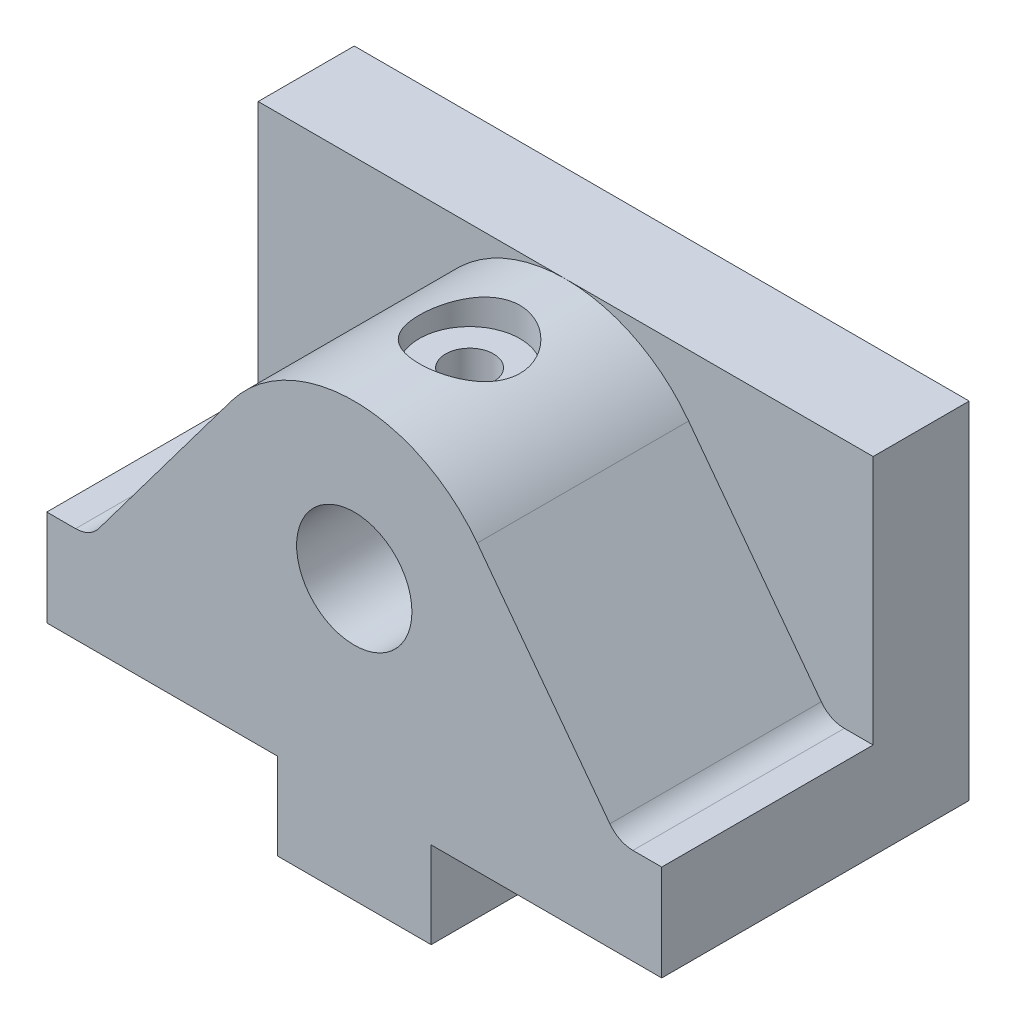
ISO-10303-21;
HEADER;
FILE_DESCRIPTION(('STEP AP214'),'2;1');
FILE_NAME('part.step','',(''),(''),'','','');
FILE_SCHEMA(('AUTOMOTIVE_DESIGN { 1 0 10303 214 1 1 1 1 }'));
ENDSEC;
DATA;
#1=APPLICATION_CONTEXT('core data for automotive mechanical design processes');
#2=APPLICATION_PROTOCOL_DEFINITION('international standard','automotive_design',2000,#1);
#3=PRODUCT_CONTEXT('',#1,'mechanical');
#4=PRODUCT('Part','Part','',(#3));
#5=PRODUCT_RELATED_PRODUCT_CATEGORY('part','',(#4));
#6=PRODUCT_DEFINITION_FORMATION('','',#4);
#7=PRODUCT_DEFINITION_CONTEXT('part definition',#1,'design');
#8=PRODUCT_DEFINITION('design','',#6,#7);
#9=PRODUCT_DEFINITION_SHAPE('','',#8);
#10=(LENGTH_UNIT() NAMED_UNIT(*) SI_UNIT(.MILLI.,.METRE.));
#11=(NAMED_UNIT(*) PLANE_ANGLE_UNIT() SI_UNIT($,.RADIAN.));
#12=(NAMED_UNIT(*) SI_UNIT($,.STERADIAN.) SOLID_ANGLE_UNIT());
#13=UNCERTAINTY_MEASURE_WITH_UNIT(LENGTH_MEASURE(1.E-05),#10,'distance_accuracy_value','');
#14=(GEOMETRIC_REPRESENTATION_CONTEXT(3) GLOBAL_UNCERTAINTY_ASSIGNED_CONTEXT((#13)) GLOBAL_UNIT_ASSIGNED_CONTEXT((#10,
#11,#12)) REPRESENTATION_CONTEXT('',''));
#15=CARTESIAN_POINT('',(0.,0.,0.));
#16=DIRECTION('',(0.,0.,1.));
#17=DIRECTION('',(1.,0.,0.));
#18=AXIS2_PLACEMENT_3D('',#15,#16,#17);
#19=CARTESIAN_POINT('',(32.,22.,32.));
#20=DIRECTION('',(-1.,0.,0.));
#21=DIRECTION('',(0.,-1.,0.));
#22=AXIS2_PLACEMENT_3D('',#19,#20,#21);
#23=PLANE('',#22);
#24=DIRECTION('',(0.,-1.,0.));
#25=VECTOR('',#24,1.);
#26=CARTESIAN_POINT('',(32.,22.,10.));
#27=LINE('',#26,#25);
#28=CARTESIAN_POINT('',(32.,22.,10.));
#29=VERTEX_POINT('',#28);
#30=CARTESIAN_POINT('',(32.,-4.,10.));
#31=VERTEX_POINT('',#30);
#32=EDGE_CURVE('E321',#29,#31,#27,.T.);
#33=ORIENTED_EDGE('',*,*,#32,.T.);
#34=DIRECTION('',(0.,0.,1.));
#35=VECTOR('',#34,1.);
#36=CARTESIAN_POINT('',(32.,-4.,32.));
#37=LINE('',#36,#35);
#38=CARTESIAN_POINT('',(32.,-4.,32.));
#39=VERTEX_POINT('',#38);
#40=EDGE_CURVE('E310',#31,#39,#37,.T.);
#41=ORIENTED_EDGE('',*,*,#40,.T.);
#42=DIRECTION('',(0.,1.,0.));
#43=VECTOR('',#42,1.);
#44=CARTESIAN_POINT('',(32.,22.,32.));
#45=LINE('',#44,#43);
#46=CARTESIAN_POINT('',(32.,-14.,32.));
#47=VERTEX_POINT('',#46);
#48=EDGE_CURVE('E324',#47,#39,#45,.T.);
#49=ORIENTED_EDGE('',*,*,#48,.F.);
#50=DIRECTION('',(0.,0.,-1.));
#51=VECTOR('',#50,1.);
#52=CARTESIAN_POINT('',(32.,-14.,32.));
#53=LINE('',#52,#51);
#54=CARTESIAN_POINT('',(32.,-14.,0.));
#55=VERTEX_POINT('',#54);
#56=EDGE_CURVE('E340',#47,#55,#53,.T.);
#57=ORIENTED_EDGE('',*,*,#56,.T.);
#58=DIRECTION('',(0.,1.,0.));
#59=VECTOR('',#58,1.);
#60=CARTESIAN_POINT('',(32.,22.,0.));
#61=LINE('',#60,#59);
#62=CARTESIAN_POINT('',(32.,22.,0.));
#63=VERTEX_POINT('',#62);
#64=EDGE_CURVE('E323',#55,#63,#61,.T.);
#65=ORIENTED_EDGE('',*,*,#64,.T.);
#66=DIRECTION('',(0.,0.,-1.));
#67=VECTOR('',#66,1.);
#68=CARTESIAN_POINT('',(32.,22.,32.));
#69=LINE('',#68,#67);
#70=EDGE_CURVE('E294',#29,#63,#69,.T.);
#71=ORIENTED_EDGE('',*,*,#70,.F.);
#72=EDGE_LOOP('',(#33,#41,#49,#57,#65,#71));
#73=FACE_BOUND('',#72,.T.);
#74=ADVANCED_FACE('F33',(#73),#23,.F.);
#75=CARTESIAN_POINT('',(-32.,22.,32.));
#76=DIRECTION('',(0.,-1.,0.));
#77=DIRECTION('',(1.,0.,0.));
#78=AXIS2_PLACEMENT_3D('',#75,#76,#77);
#79=PLANE('',#78);
#80=DIRECTION('',(0.,0.,-1.));
#81=VECTOR('',#80,1.);
#82=CARTESIAN_POINT('',(-32.,22.,32.));
#83=LINE('',#82,#81);
#84=CARTESIAN_POINT('',(-32.,22.,10.));
#85=VERTEX_POINT('',#84);
#86=CARTESIAN_POINT('',(-32.,22.,0.));
#87=VERTEX_POINT('',#86);
#88=EDGE_CURVE('E374',#85,#87,#83,.T.);
#89=ORIENTED_EDGE('',*,*,#88,.F.);
#90=DIRECTION('',(1.,0.,0.));
#91=VECTOR('',#90,1.);
#92=CARTESIAN_POINT('',(-32.,22.,10.));
#93=LINE('',#92,#91);
#94=CARTESIAN_POINT('',(0.,22.,10.));
#95=VERTEX_POINT('',#94);
#96=EDGE_CURVE('E317',#85,#95,#93,.T.);
#97=ORIENTED_EDGE('',*,*,#96,.T.);
#98=EDGE_CURVE('E320',#95,#29,#93,.T.);
#99=ORIENTED_EDGE('',*,*,#98,.T.);
#100=ORIENTED_EDGE('',*,*,#70,.T.);
#101=DIRECTION('',(-1.,0.,0.));
#102=VECTOR('',#101,1.);
#103=CARTESIAN_POINT('',(-32.,22.,0.));
#104=LINE('',#103,#102);
#105=EDGE_CURVE('E343',#63,#87,#104,.T.);
#106=ORIENTED_EDGE('',*,*,#105,.T.);
#107=EDGE_LOOP('',(#89,#97,#99,#100,#106));
#108=FACE_BOUND('',#107,.T.);
#109=ADVANCED_FACE('F228',(#108),#79,.F.);
#110=CARTESIAN_POINT('',(-32.,22.,32.));
#111=DIRECTION('',(1.,0.,0.));
#112=DIRECTION('',(0.,1.,0.));
#113=AXIS2_PLACEMENT_3D('',#110,#111,#112);
#114=PLANE('',#113);
#115=DIRECTION('',(0.,-1.,0.));
#116=VECTOR('',#115,1.);
#117=CARTESIAN_POINT('',(-32.,22.,32.));
#118=LINE('',#117,#116);
#119=CARTESIAN_POINT('',(-32.,-4.,32.));
#120=VERTEX_POINT('',#119);
#121=CARTESIAN_POINT('',(-32.,-14.,32.));
#122=VERTEX_POINT('',#121);
#123=EDGE_CURVE('E327',#120,#122,#118,.T.);
#124=ORIENTED_EDGE('',*,*,#123,.F.);
#125=DIRECTION('',(0.,0.,-1.));
#126=VECTOR('',#125,1.);
#127=CARTESIAN_POINT('',(-32.,-4.,32.));
#128=LINE('',#127,#126);
#129=CARTESIAN_POINT('',(-32.,-4.,10.));
#130=VERTEX_POINT('',#129);
#131=EDGE_CURVE('E314',#120,#130,#128,.T.);
#132=ORIENTED_EDGE('',*,*,#131,.T.);
#133=DIRECTION('',(0.,1.,0.));
#134=VECTOR('',#133,1.);
#135=CARTESIAN_POINT('',(-32.,22.,10.));
#136=LINE('',#135,#134);
#137=EDGE_CURVE('E378',#130,#85,#136,.T.);
#138=ORIENTED_EDGE('',*,*,#137,.T.);
#139=ORIENTED_EDGE('',*,*,#88,.T.);
#140=DIRECTION('',(0.,-1.,0.));
#141=VECTOR('',#140,1.);
#142=CARTESIAN_POINT('',(-32.,22.,0.));
#143=LINE('',#142,#141);
#144=CARTESIAN_POINT('',(-32.,-14.,0.));
#145=VERTEX_POINT('',#144);
#146=EDGE_CURVE('E346',#87,#145,#143,.T.);
#147=ORIENTED_EDGE('',*,*,#146,.T.);
#148=DIRECTION('',(0.,0.,-1.));
#149=VECTOR('',#148,1.);
#150=CARTESIAN_POINT('',(-32.,-14.,32.));
#151=LINE('',#150,#149);
#152=EDGE_CURVE('E371',#122,#145,#151,.T.);
#153=ORIENTED_EDGE('',*,*,#152,.F.);
#154=EDGE_LOOP('',(#124,#132,#138,#139,#147,#153));
#155=FACE_BOUND('',#154,.T.);
#156=ADVANCED_FACE('F234',(#155),#114,.F.);
#157=CARTESIAN_POINT('',(-32.,-14.,32.));
#158=DIRECTION('',(0.,1.,0.));
#159=DIRECTION('',(-1.,0.,0.));
#160=AXIS2_PLACEMENT_3D('',#157,#158,#159);
#161=PLANE('',#160);
#162=DIRECTION('',(1.,0.,0.));
#163=VECTOR('',#162,1.);
#164=CARTESIAN_POINT('',(-32.,-14.,0.));
#165=LINE('',#164,#163);
#166=CARTESIAN_POINT('',(-7.99999999999999,-14.,0.));
#167=VERTEX_POINT('',#166);
#168=EDGE_CURVE('E348',#145,#167,#165,.T.);
#169=ORIENTED_EDGE('',*,*,#168,.T.);
#170=DIRECTION('',(0.,0.,-1.));
#171=VECTOR('',#170,1.);
#172=CARTESIAN_POINT('',(-7.99999999999999,-14.,32.));
#173=LINE('',#172,#171);
#174=CARTESIAN_POINT('',(-7.99999999999999,-14.,32.));
#175=VERTEX_POINT('',#174);
#176=EDGE_CURVE('E368',#175,#167,#173,.T.);
#177=ORIENTED_EDGE('',*,*,#176,.F.);
#178=DIRECTION('',(1.,0.,0.));
#179=VECTOR('',#178,1.);
#180=CARTESIAN_POINT('',(-32.,-14.,32.));
#181=LINE('',#180,#179);
#182=EDGE_CURVE('E330',#122,#175,#181,.T.);
#183=ORIENTED_EDGE('',*,*,#182,.F.);
#184=ORIENTED_EDGE('',*,*,#152,.T.);
#185=EDGE_LOOP('',(#169,#177,#183,#184));
#186=FACE_BOUND('',#185,.T.);
#187=ADVANCED_FACE('F394',(#186),#161,.F.);
#188=CARTESIAN_POINT('',(-7.99999999999999,-14.,32.));
#189=DIRECTION('',(1.,0.,0.));
#190=DIRECTION('',(0.,1.,0.));
#191=AXIS2_PLACEMENT_3D('',#188,#189,#190);
#192=PLANE('',#191);
#193=DIRECTION('',(0.,-1.,0.));
#194=VECTOR('',#193,1.);
#195=CARTESIAN_POINT('',(-7.99999999999999,-14.,0.));
#196=LINE('',#195,#194);
#197=CARTESIAN_POINT('',(-7.99999999999999,-23.,0.));
#198=VERTEX_POINT('',#197);
#199=EDGE_CURVE('E350',#167,#198,#196,.T.);
#200=ORIENTED_EDGE('',*,*,#199,.T.);
#201=DIRECTION('',(0.,0.,-1.));
#202=VECTOR('',#201,1.);
#203=CARTESIAN_POINT('',(-7.99999999999999,-23.,32.));
#204=LINE('',#203,#202);
#205=CARTESIAN_POINT('',(-7.99999999999999,-23.,32.));
#206=VERTEX_POINT('',#205);
#207=EDGE_CURVE('E365',#206,#198,#204,.T.);
#208=ORIENTED_EDGE('',*,*,#207,.F.);
#209=DIRECTION('',(0.,-1.,0.));
#210=VECTOR('',#209,1.);
#211=CARTESIAN_POINT('',(-7.99999999999999,-14.,32.));
#212=LINE('',#211,#210);
#213=EDGE_CURVE('E332',#175,#206,#212,.T.);
#214=ORIENTED_EDGE('',*,*,#213,.F.);
#215=ORIENTED_EDGE('',*,*,#176,.T.);
#216=EDGE_LOOP('',(#200,#208,#214,#215));
#217=FACE_BOUND('',#216,.T.);
#218=ADVANCED_FACE('F398',(#217),#192,.F.);
#219=CARTESIAN_POINT('',(8.00000000000001,-23.,32.));
#220=DIRECTION('',(0.,1.,0.));
#221=DIRECTION('',(-1.,0.,0.));
#222=AXIS2_PLACEMENT_3D('',#219,#220,#221);
#223=PLANE('',#222);
#224=CARTESIAN_POINT('',(0.,-23.,24.));
#225=DIRECTION('',(0.,-1.,0.));
#226=DIRECTION('',(0.,0.,-1.));
#227=AXIS2_PLACEMENT_3D('',#224,#225,#226);
#228=CIRCLE('',#227,2.49999999999999);
#229=CARTESIAN_POINT('',(0.,-23.,21.5));
#230=VERTEX_POINT('',#229);
#231=EDGE_CURVE('E174',#230,#230,#228,.T.);
#232=ORIENTED_EDGE('',*,*,#231,.F.);
#233=EDGE_LOOP('',(#232));
#234=FACE_BOUND('',#233,.T.);
#235=CARTESIAN_POINT('',(0.,-23.,8.));
#236=DIRECTION('',(0.,-1.,0.));
#237=DIRECTION('',(0.,0.,-1.));
#238=AXIS2_PLACEMENT_3D('',#235,#236,#237);
#239=CIRCLE('',#238,2.49999999999999);
#240=CARTESIAN_POINT('',(0.,-23.,5.50000000000001));
#241=VERTEX_POINT('',#240);
#242=EDGE_CURVE('E173',#241,#241,#239,.T.);
#243=ORIENTED_EDGE('',*,*,#242,.F.);
#244=EDGE_LOOP('',(#243));
#245=FACE_BOUND('',#244,.T.);
#246=DIRECTION('',(1.,0.,0.));
#247=VECTOR('',#246,1.);
#248=CARTESIAN_POINT('',(8.00000000000001,-23.,0.));
#249=LINE('',#248,#247);
#250=CARTESIAN_POINT('',(8.00000000000001,-23.,0.));
#251=VERTEX_POINT('',#250);
#252=EDGE_CURVE('E352',#198,#251,#249,.T.);
#253=ORIENTED_EDGE('',*,*,#252,.T.);
#254=DIRECTION('',(0.,0.,-1.));
#255=VECTOR('',#254,1.);
#256=CARTESIAN_POINT('',(8.00000000000001,-23.,32.));
#257=LINE('',#256,#255);
#258=CARTESIAN_POINT('',(8.00000000000001,-23.,32.));
#259=VERTEX_POINT('',#258);
#260=EDGE_CURVE('E362',#259,#251,#257,.T.);
#261=ORIENTED_EDGE('',*,*,#260,.F.);
#262=DIRECTION('',(1.,0.,0.));
#263=VECTOR('',#262,1.);
#264=CARTESIAN_POINT('',(8.00000000000001,-23.,32.));
#265=LINE('',#264,#263);
#266=EDGE_CURVE('E334',#206,#259,#265,.T.);
#267=ORIENTED_EDGE('',*,*,#266,.F.);
#268=ORIENTED_EDGE('',*,*,#207,.T.);
#269=EDGE_LOOP('',(#253,#261,#267,#268));
#270=FACE_BOUND('',#269,.T.);
#271=ADVANCED_FACE('F403',(#234,#245,#270),#223,.F.);
#272=CARTESIAN_POINT('',(8.00000000000001,-14.,32.));
#273=DIRECTION('',(-1.,0.,0.));
#274=DIRECTION('',(0.,-1.,0.));
#275=AXIS2_PLACEMENT_3D('',#272,#273,#274);
#276=PLANE('',#275);
#277=DIRECTION('',(0.,1.,0.));
#278=VECTOR('',#277,1.);
#279=CARTESIAN_POINT('',(8.00000000000001,-14.,0.));
#280=LINE('',#279,#278);
#281=CARTESIAN_POINT('',(8.00000000000001,-14.,0.));
#282=VERTEX_POINT('',#281);
#283=EDGE_CURVE('E354',#251,#282,#280,.T.);
#284=ORIENTED_EDGE('',*,*,#283,.T.);
#285=DIRECTION('',(0.,0.,-1.));
#286=VECTOR('',#285,1.);
#287=CARTESIAN_POINT('',(8.00000000000001,-14.,32.));
#288=LINE('',#287,#286);
#289=CARTESIAN_POINT('',(8.00000000000001,-14.,32.));
#290=VERTEX_POINT('',#289);
#291=EDGE_CURVE('E359',#290,#282,#288,.T.);
#292=ORIENTED_EDGE('',*,*,#291,.F.);
#293=DIRECTION('',(0.,1.,0.));
#294=VECTOR('',#293,1.);
#295=CARTESIAN_POINT('',(8.00000000000001,-14.,32.));
#296=LINE('',#295,#294);
#297=EDGE_CURVE('E336',#259,#290,#296,.T.);
#298=ORIENTED_EDGE('',*,*,#297,.F.);
#299=ORIENTED_EDGE('',*,*,#260,.T.);
#300=EDGE_LOOP('',(#284,#292,#298,#299));
#301=FACE_BOUND('',#300,.T.);
#302=ADVANCED_FACE('F409',(#301),#276,.F.);
#303=CARTESIAN_POINT('',(32.,-14.,32.));
#304=DIRECTION('',(0.,1.,0.));
#305=DIRECTION('',(-1.,0.,0.));
#306=AXIS2_PLACEMENT_3D('',#303,#304,#305);
#307=PLANE('',#306);
#308=DIRECTION('',(1.,0.,0.));
#309=VECTOR('',#308,1.);
#310=CARTESIAN_POINT('',(32.,-14.,0.));
#311=LINE('',#310,#309);
#312=EDGE_CURVE('E328',#282,#55,#311,.T.);
#313=ORIENTED_EDGE('',*,*,#312,.T.);
#314=ORIENTED_EDGE('',*,*,#56,.F.);
#315=DIRECTION('',(1.,0.,0.));
#316=VECTOR('',#315,1.);
#317=CARTESIAN_POINT('',(32.,-14.,32.));
#318=LINE('',#317,#316);
#319=EDGE_CURVE('E338',#290,#47,#318,.T.);
#320=ORIENTED_EDGE('',*,*,#319,.F.);
#321=ORIENTED_EDGE('',*,*,#291,.T.);
#322=EDGE_LOOP('',(#313,#314,#320,#321));
#323=FACE_BOUND('',#322,.T.);
#324=ADVANCED_FACE('F413',(#323),#307,.F.);
#325=CARTESIAN_POINT('',(32.,-23.,32.));
#326=DIRECTION('',(0.,0.,-1.));
#327=DIRECTION('',(-1.,0.,0.));
#328=AXIS2_PLACEMENT_3D('',#325,#326,#327);
#329=PLANE('',#328);
#330=CARTESIAN_POINT('',(0.,6.,32.));
#331=DIRECTION('',(0.,0.,1.));
#332=DIRECTION('',(1.,0.,0.));
#333=AXIS2_PLACEMENT_3D('',#330,#331,#332);
#334=CIRCLE('',#333,6.);
#335=CARTESIAN_POINT('',(6.,6.,32.));
#336=VERTEX_POINT('',#335);
#337=EDGE_CURVE('E197',#336,#336,#334,.T.);
#338=ORIENTED_EDGE('',*,*,#337,.F.);
#339=EDGE_LOOP('',(#338));
#340=FACE_BOUND('',#339,.T.);
#341=DIRECTION('',(0.6,0.8,0.));
#342=VECTOR('',#341,1.);
#343=CARTESIAN_POINT('',(-12.8,15.6,32.));
#344=LINE('',#343,#342);
#345=CARTESIAN_POINT('',(-26.6,-2.80000000000001,32.));
#346=VERTEX_POINT('',#345);
#347=CARTESIAN_POINT('',(-12.8,15.6,32.));
#348=VERTEX_POINT('',#347);
#349=EDGE_CURVE('E300',#346,#348,#344,.T.);
#350=ORIENTED_EDGE('',*,*,#349,.F.);
#351=CARTESIAN_POINT('',(-29.,-1.00000000000001,32.));
#352=DIRECTION('',(0.,0.,-1.));
#353=DIRECTION('',(-1.,0.,0.));
#354=AXIS2_PLACEMENT_3D('',#351,#352,#353);
#355=CIRCLE('',#354,3.);
#356=CARTESIAN_POINT('',(-29.,-4.00000000000001,32.));
#357=VERTEX_POINT('',#356);
#358=EDGE_CURVE('E271',#346,#357,#355,.T.);
#359=ORIENTED_EDGE('',*,*,#358,.T.);
#360=DIRECTION('',(-1.,0.,0.));
#361=VECTOR('',#360,1.);
#362=CARTESIAN_POINT('',(32.,-4.00000000000004,32.));
#363=LINE('',#362,#361);
#364=EDGE_CURVE('E293',#357,#120,#363,.T.);
#365=ORIENTED_EDGE('',*,*,#364,.T.);
#366=ORIENTED_EDGE('',*,*,#123,.T.);
#367=ORIENTED_EDGE('',*,*,#182,.T.);
#368=ORIENTED_EDGE('',*,*,#213,.T.);
#369=ORIENTED_EDGE('',*,*,#266,.T.);
#370=ORIENTED_EDGE('',*,*,#297,.T.);
#371=ORIENTED_EDGE('',*,*,#319,.T.);
#372=ORIENTED_EDGE('',*,*,#48,.T.);
#373=DIRECTION('',(1.,0.,0.));
#374=VECTOR('',#373,1.);
#375=CARTESIAN_POINT('',(38.9732794450173,-4.,32.));
#376=LINE('',#375,#374);
#377=CARTESIAN_POINT('',(29.,-4.,32.));
#378=VERTEX_POINT('',#377);
#379=EDGE_CURVE('E298',#378,#39,#376,.T.);
#380=ORIENTED_EDGE('',*,*,#379,.F.);
#381=CARTESIAN_POINT('',(29.,-0.999999999999997,32.));
#382=DIRECTION('',(0.,0.,-1.));
#383=DIRECTION('',(-1.,0.,0.));
#384=AXIS2_PLACEMENT_3D('',#381,#382,#383);
#385=CIRCLE('',#384,3.);
#386=CARTESIAN_POINT('',(26.6,-2.8,32.));
#387=VERTEX_POINT('',#386);
#388=EDGE_CURVE('E272',#378,#387,#385,.T.);
#389=ORIENTED_EDGE('',*,*,#388,.T.);
#390=DIRECTION('',(0.6,-0.8,0.));
#391=VECTOR('',#390,1.);
#392=CARTESIAN_POINT('',(12.8,15.6,32.));
#393=LINE('',#392,#391);
#394=CARTESIAN_POINT('',(12.8,15.6,32.));
#395=VERTEX_POINT('',#394);
#396=EDGE_CURVE('E296',#395,#387,#393,.T.);
#397=ORIENTED_EDGE('',*,*,#396,.F.);
#398=CARTESIAN_POINT('',(0.,6.,32.));
#399=DIRECTION('',(0.,0.,-1.));
#400=DIRECTION('',(-1.,0.,0.));
#401=AXIS2_PLACEMENT_3D('',#398,#399,#400);
#402=CIRCLE('',#401,16.);
#403=EDGE_CURVE('E286',#395,#348,#402,.F.);
#404=ORIENTED_EDGE('',*,*,#403,.T.);
#405=EDGE_LOOP('',(#350,#359,#365,#366,#367,#368,#369,#370,#371,#372,#380,#389,#397,#404));
#406=FACE_BOUND('',#405,.T.);
#407=ADVANCED_FACE('F297',(#340,#406),#329,.F.);
#408=CARTESIAN_POINT('',(32.,-23.,0.));
#409=DIRECTION('',(0.,0.,-1.));
#410=DIRECTION('',(-1.,0.,0.));
#411=AXIS2_PLACEMENT_3D('',#408,#409,#410);
#412=PLANE('',#411);
#413=ORIENTED_EDGE('',*,*,#64,.F.);
#414=ORIENTED_EDGE('',*,*,#312,.F.);
#415=ORIENTED_EDGE('',*,*,#283,.F.);
#416=ORIENTED_EDGE('',*,*,#252,.F.);
#417=ORIENTED_EDGE('',*,*,#199,.F.);
#418=ORIENTED_EDGE('',*,*,#168,.F.);
#419=ORIENTED_EDGE('',*,*,#146,.F.);
#420=ORIENTED_EDGE('',*,*,#105,.F.);
#421=EDGE_LOOP('',(#413,#414,#415,#416,#417,#418,#419,#420));
#422=FACE_BOUND('',#421,.T.);
#423=ADVANCED_FACE('F437',(#422),#412,.T.);
#424=CARTESIAN_POINT('',(0.,6.,10.));
#425=DIRECTION('',(0.,0.,-1.));
#426=DIRECTION('',(-1.,0.,0.));
#427=AXIS2_PLACEMENT_3D('',#424,#425,#426);
#428=PLANE('',#427);
#429=DIRECTION('',(0.6,-0.8,0.));
#430=VECTOR('',#429,1.);
#431=CARTESIAN_POINT('',(12.8,15.6,10.));
#432=LINE('',#431,#430);
#433=CARTESIAN_POINT('',(12.8,15.6,10.));
#434=VERTEX_POINT('',#433);
#435=CARTESIAN_POINT('',(26.6,-2.8,10.));
#436=VERTEX_POINT('',#435);
#437=EDGE_CURVE('E425',#434,#436,#432,.T.);
#438=ORIENTED_EDGE('',*,*,#437,.T.);
#439=CARTESIAN_POINT('',(29.,-0.999999999999997,10.));
#440=DIRECTION('',(0.,0.,-1.));
#441=DIRECTION('',(-1.,0.,0.));
#442=AXIS2_PLACEMENT_3D('',#439,#440,#441);
#443=CIRCLE('',#442,3.);
#444=CARTESIAN_POINT('',(29.,-4.,10.));
#445=VERTEX_POINT('',#444);
#446=EDGE_CURVE('E269',#436,#445,#443,.F.);
#447=ORIENTED_EDGE('',*,*,#446,.T.);
#448=DIRECTION('',(1.,0.,0.));
#449=VECTOR('',#448,1.);
#450=CARTESIAN_POINT('',(27.5,-4.,10.));
#451=LINE('',#450,#449);
#452=EDGE_CURVE('E421',#445,#31,#451,.T.);
#453=ORIENTED_EDGE('',*,*,#452,.T.);
#454=ORIENTED_EDGE('',*,*,#32,.F.);
#455=ORIENTED_EDGE('',*,*,#98,.F.);
#456=CARTESIAN_POINT('',(0.,6.,10.));
#457=DIRECTION('',(0.,0.,-1.));
#458=DIRECTION('',(-1.,0.,0.));
#459=AXIS2_PLACEMENT_3D('',#456,#457,#458);
#460=CIRCLE('',#459,16.);
#461=EDGE_CURVE('E308',#95,#434,#460,.T.);
#462=ORIENTED_EDGE('',*,*,#461,.T.);
#463=EDGE_LOOP('',(#438,#447,#453,#454,#455,#462));
#464=FACE_BOUND('',#463,.T.);
#465=ADVANCED_FACE('F424',(#464),#428,.F.);
#466=DIRECTION('',(1.,0.,0.));
#467=VECTOR('',#466,1.);
#468=CARTESIAN_POINT('',(-32.,-4.,10.));
#469=LINE('',#468,#467);
#470=CARTESIAN_POINT('',(-29.,-4.,10.));
#471=VERTEX_POINT('',#470);
#472=EDGE_CURVE('E386',#130,#471,#469,.T.);
#473=ORIENTED_EDGE('',*,*,#472,.T.);
#474=CARTESIAN_POINT('',(-29.,-1.00000000000001,10.));
#475=DIRECTION('',(0.,0.,-1.));
#476=DIRECTION('',(-1.,0.,0.));
#477=AXIS2_PLACEMENT_3D('',#474,#475,#476);
#478=CIRCLE('',#477,3.);
#479=CARTESIAN_POINT('',(-26.6,-2.80000000000001,10.));
#480=VERTEX_POINT('',#479);
#481=EDGE_CURVE('E254',#471,#480,#478,.F.);
#482=ORIENTED_EDGE('',*,*,#481,.T.);
#483=DIRECTION('',(0.6,0.8,0.));
#484=VECTOR('',#483,1.);
#485=CARTESIAN_POINT('',(-12.8,15.6,10.));
#486=LINE('',#485,#484);
#487=CARTESIAN_POINT('',(-12.8,15.6,10.));
#488=VERTEX_POINT('',#487);
#489=EDGE_CURVE('E304',#480,#488,#486,.T.);
#490=ORIENTED_EDGE('',*,*,#489,.T.);
#491=EDGE_CURVE('E426',#488,#95,#460,.T.);
#492=ORIENTED_EDGE('',*,*,#491,.T.);
#493=ORIENTED_EDGE('',*,*,#96,.F.);
#494=ORIENTED_EDGE('',*,*,#137,.F.);
#495=EDGE_LOOP('',(#473,#482,#490,#492,#493,#494));
#496=FACE_BOUND('',#495,.T.);
#497=ADVANCED_FACE('F281',(#496),#428,.F.);
#498=CARTESIAN_POINT('',(0.,6.,10.));
#499=DIRECTION('',(0.,0.,1.));
#500=DIRECTION('',(1.,0.,0.));
#501=AXIS2_PLACEMENT_3D('',#498,#499,#500);
#502=CYLINDRICAL_SURFACE('',#501,16.);
#503=CARTESIAN_POINT('',(0.,22.,25.25));
#504=CARTESIAN_POINT('',(-0.286709494058984,22.0000001897405,25.2500005347309));
#505=CARTESIAN_POINT('',(-0.573418003951394,21.9922220658582,25.2264371563873));
#506=CARTESIAN_POINT('',(-1.13840576132322,21.9619585592063,25.1330830739778));
#507=CARTESIAN_POINT('',(-1.41668386820625,21.9394711955573,25.0632861436672));
#508=CARTESIAN_POINT('',(-1.95658170749336,21.8822364786346,24.8801076160714));
#509=CARTESIAN_POINT('',(-2.21822794950095,21.8475092439196,24.7667975137658));
#510=CARTESIAN_POINT('',(-2.71880895600236,21.7693480735265,24.5001149495774));
#511=CARTESIAN_POINT('',(-2.95773945003689,21.7259125054731,24.34673497497));
#512=CARTESIAN_POINT('',(-3.41412925138217,21.6332861687674,23.9988845958574));
#513=CARTESIAN_POINT('',(-3.63071644054429,21.5839607060278,23.8033080399097));
#514=CARTESIAN_POINT('',(-4.02875232037423,21.4858403608169,23.3787904179321));
#515=CARTESIAN_POINT('',(-4.2101935902573,21.4370455924459,23.1498423236085));
#516=CARTESIAN_POINT('',(-4.45451830356468,21.3676517691191,22.7824972479474));
#517=CARTESIAN_POINT('',(-4.5321901115046,21.3448664184458,22.6541120150121));
#518=CARTESIAN_POINT('',(-4.67639137549196,21.301536747389,22.3908881855436));
#519=CARTESIAN_POINT('',(-4.7429252321784,21.2809915430406,22.2560521649401));
#520=CARTESIAN_POINT('',(-4.86431443320129,21.2427851894381,21.9808035106813));
#521=CARTESIAN_POINT('',(-4.91916761800706,21.2251245736289,21.8403898515122));
#522=CARTESIAN_POINT('',(-5.01667019111925,21.1932765519028,21.5550669720235));
#523=CARTESIAN_POINT('',(-5.05932510352247,21.1790875742452,21.4101598196824));
#524=CARTESIAN_POINT('',(-5.13086527296411,21.1550519646133,21.12164663784));
#525=CARTESIAN_POINT('',(-5.16015188436523,21.1450795372306,20.978150565979));
#526=CARTESIAN_POINT('',(-5.20664321587924,21.1291596663119,20.6890504881627));
#527=CARTESIAN_POINT('',(-5.22385294589357,21.123210553805,20.5434473818911));
#528=CARTESIAN_POINT('',(-5.24603342598851,21.1155308115328,20.251209374142));
#529=CARTESIAN_POINT('',(-5.25100491250198,21.1137999279368,20.1045745352814));
#530=CARTESIAN_POINT('',(-5.24865901633969,21.1146148069458,19.8114172421408));
#531=CARTESIAN_POINT('',(-5.24134196648386,21.1171604537262,19.6648947849247));
#532=CARTESIAN_POINT('',(-5.21509263870949,21.1262351246141,19.3795858193609));
#533=CARTESIAN_POINT('',(-5.19668986676652,21.1325824862121,19.2407444107946));
#534=CARTESIAN_POINT('',(-5.14889539776691,21.1489112936161,18.965135878479));
#535=CARTESIAN_POINT('',(-5.1194999964824,21.1588939643962,18.828369470134));
#536=CARTESIAN_POINT('',(-5.04999045137727,21.1821914484956,18.5579235776126));
#537=CARTESIAN_POINT('',(-5.00987934257876,21.1955053182481,18.4242432309965));
#538=CARTESIAN_POINT('',(-4.91925343004357,21.2250851162793,18.1607425099973));
#539=CARTESIAN_POINT('',(-4.86873466670011,21.2413521678197,18.030923626288));
#540=CARTESIAN_POINT('',(-4.75683410373241,21.2766495121335,17.7740280823927));
#541=CARTESIAN_POINT('',(-4.69529758904871,21.2957183563687,17.6470240102845));
#542=CARTESIAN_POINT('',(-4.56236027484898,21.3358955560192,17.3986071202728));
#543=CARTESIAN_POINT('',(-4.49095589174926,21.3570046515248,17.2771963550716));
#544=CARTESIAN_POINT('',(-4.26265776862839,21.422542122284,16.9224695079162));
#545=CARTESIAN_POINT('',(-4.09159662020304,21.4692078665236,16.6984705092107));
#546=CARTESIAN_POINT('',(-3.706627770054,21.5660589157136,16.2703200516024));
#547=CARTESIAN_POINT('',(-3.49099291116374,21.6163029652654,16.0677415738092));
#548=CARTESIAN_POINT('',(-3.02816716021724,21.7126062393532,15.701186080797));
#549=CARTESIAN_POINT('',(-2.7809734296899,21.7586650868249,15.5372125415648));
#550=CARTESIAN_POINT('',(-2.25882664134598,21.8419744566544,15.2513585497954));
#551=CARTESIAN_POINT('',(-1.98363559451818,21.8791385738647,15.1298860994002));
#552=CARTESIAN_POINT('',(-1.41521430787529,21.9398466309394,14.9354362815638));
#553=CARTESIAN_POINT('',(-1.12199016810802,21.9633951488146,14.8624426127383));
#554=CARTESIAN_POINT('',(-0.53909902911973,21.9934654344729,14.7697735124911));
#555=CARTESIAN_POINT('',(-0.249803097585898,22.0006630803015,14.7479802824234));
#556=CARTESIAN_POINT('',(0.328362845056587,21.9992404879992,14.752313608519));
#557=CARTESIAN_POINT('',(0.617232917876008,21.9906228266589,14.7784323583752));
#558=CARTESIAN_POINT('',(1.17794733377434,21.958984139272,14.8761633538778));
#559=CARTESIAN_POINT('',(1.45004183666373,21.9363716965903,14.9464859323408));
#560=CARTESIAN_POINT('',(1.97847602534904,21.8794304352573,15.1290359819631));
#561=CARTESIAN_POINT('',(2.23481371033778,21.8451001322792,15.2412687621479));
#562=CARTESIAN_POINT('',(2.73180727843797,21.7671241026494,15.5076377504953));
#563=CARTESIAN_POINT('',(2.9718867059211,21.7232605671947,15.6627819043168));
#564=CARTESIAN_POINT('',(3.42338661015796,21.6311726000738,16.0095245869331));
#565=CARTESIAN_POINT('',(3.63479854568857,21.5829468758356,16.2011339395183));
#566=CARTESIAN_POINT('',(3.93080686187507,21.5099889625324,16.5167017467794));
#567=CARTESIAN_POINT('',(4.02775652038163,21.4850337480038,16.6292785904917));
#568=CARTESIAN_POINT('',(4.21184399173479,21.4359782570119,16.8623434685973));
#569=CARTESIAN_POINT('',(4.29898526880551,21.4118776807717,16.9828286858773));
#570=CARTESIAN_POINT('',(4.46288622122381,21.3652178288239,17.2310147310891));
#571=CARTESIAN_POINT('',(4.53964149310769,21.3426592088692,17.3587185872532));
#572=CARTESIAN_POINT('',(4.6821290759483,21.2997778282514,17.6204301324265));
#573=CARTESIAN_POINT('',(4.7478659821177,21.2794541367331,17.7544351635204));
#574=CARTESIAN_POINT('',(4.86768768214355,21.2417045524655,18.0276117986305));
#575=CARTESIAN_POINT('',(4.92179679000482,21.2242726307227,18.1667718941344));
#576=CARTESIAN_POINT('',(5.01803804755297,21.1928226185673,18.4494900239032));
#577=CARTESIAN_POINT('',(5.06017509489782,21.1788031324965,18.5930462330569));
#578=CARTESIAN_POINT('',(5.13209093888686,21.1546390245646,18.8835209667143));
#579=CARTESIAN_POINT('',(5.16187166240591,21.1444937985617,19.0304389631996));
#580=CARTESIAN_POINT('',(5.2087780902027,21.1284251837744,19.3265078699794));
#581=CARTESIAN_POINT('',(5.2259044057156,21.1225015910765,19.4756586720694));
#582=CARTESIAN_POINT('',(5.24678567838685,21.1152688790486,19.7674935852761));
#583=CARTESIAN_POINT('',(5.25116674901144,21.1137437203751,19.9101278919413));
#584=CARTESIAN_POINT('',(5.24830378876985,21.1147381871213,20.1953160643779));
#585=CARTESIAN_POINT('',(5.24105580266602,21.1172591887081,20.3378698862774));
#586=CARTESIAN_POINT('',(5.21500339875294,21.1262661675983,20.6217268936588));
#587=CARTESIAN_POINT('',(5.19620398463547,21.1327504281442,20.7630305937829));
#588=CARTESIAN_POINT('',(5.1472255051848,21.1494797802306,21.0434760888048));
#589=CARTESIAN_POINT('',(5.11704216659846,21.159726283989,21.1826170514157));
#590=CARTESIAN_POINT('',(5.04622046339954,21.1834458182961,21.455203960657));
#591=CARTESIAN_POINT('',(5.00578302017753,21.1968565319946,21.5887075021134));
#592=CARTESIAN_POINT('',(4.91454331395293,21.2266068707808,21.8518048789246));
#593=CARTESIAN_POINT('',(4.86373735552377,21.2429475398767,21.9813973013677));
#594=CARTESIAN_POINT('',(4.69633894845901,21.2956907323093,22.3630333944629));
#595=CARTESIAN_POINT('',(4.56470890354328,21.335834545691,22.6081538508076));
#596=CARTESIAN_POINT('',(4.25873630797536,21.4236656144067,23.083679104434));
#597=CARTESIAN_POINT('',(4.08281598726617,21.4716009884101,23.3130154606863));
#598=CARTESIAN_POINT('',(3.69589864688006,21.5685600712772,23.739756946782));
#599=CARTESIAN_POINT('',(3.48489185030561,21.6175840801821,23.937153146119));
#600=CARTESIAN_POINT('',(3.02434678220256,21.7133890905722,24.3017743991678));
#601=CARTESIAN_POINT('',(2.77366444084677,21.7600181131568,24.4675986111951));
#602=CARTESIAN_POINT('',(2.24646513288389,21.8437522184225,24.7545648607591));
#603=CARTESIAN_POINT('',(1.96995573058801,21.8808600778355,24.8757199300244));
#604=CARTESIAN_POINT('',(1.41459012804233,21.9396537229862,25.0638536279503));
#605=CARTESIAN_POINT('',(1.13669576816015,21.9620741979851,25.1334408794924));
#606=CARTESIAN_POINT('',(0.572532504251399,21.9922453654215,25.2265079011325));
#607=CARTESIAN_POINT('',(0.286265761564401,21.9999998105531,25.2499994660966));
#608=CARTESIAN_POINT('',(0.,22.,25.25));
#609=B_SPLINE_CURVE_WITH_KNOTS('',3,(#503,#504,#505,#506,#507,#508,#509,#510,#511,#512,#513,
#514,#515,#516,#517,#518,#519,#520,#521,#522,#523,#524,#525,#526,#527,#528,#529,#530,#531,#532,
#533,#534,#535,#536,#537,#538,#539,#540,#541,#542,#543,#544,#545,#546,#547,#548,#549,#550,#551,
#552,#553,#554,#555,#556,#557,#558,#559,#560,#561,#562,#563,#564,#565,#566,#567,#568,#569,#570,
#571,#572,#573,#574,#575,#576,#577,#578,#579,#580,#581,#582,#583,#584,#585,#586,#587,#588,#589,
#590,#591,#592,#593,#594,#595,#596,#597,#598,#599,#600,#601,#602,#603,#604,#605,#606,#607,#608),
.UNSPECIFIED.,.T.,.F.,(4,2,2,2,2,2,2,2,2,2,2,2,2,2,2,2,2,2,2,2,2,2,2,2,2,2,2,2,2,2,2,2,2,2,2,2,
2,2,2,2,2,2,2,2,2,2,2,2,2,2,2,2,4),(0.,0.859075428591242,1.71826657188333,2.57605200682381,
3.43399838404033,4.31799257628807,5.20217321399858,5.65702442607412,6.11169549868644,
6.56645055835826,7.02099935082878,7.46082097100718,7.90046003018,8.34007263354904,
8.77967333074153,9.19977850619227,9.62002537382395,10.0401533404152,10.4604414414388,
10.8871751344489,11.3140642079497,12.1672273155506,13.0634636469387,13.9597806445666,
14.8644801274702,15.7688752435887,16.6351478594897,17.5012793459801,18.3432445177785,
19.1853163827372,20.0491497062765,20.9132398383775,21.3647510218317,21.8161022322254,
22.2676442111049,22.7189974031621,23.1693974179903,23.6196129122126,24.0697581723363,
24.5198816880529,24.9474850767332,25.375233931345,25.8027976299696,26.2305219857832,
26.6504379950248,27.0705039280789,27.9099651741898,28.7851100564912,29.6604992091048,
30.5685564145736,31.476348494375,32.3343139182739,33.1920597791638),.UNSPECIFIED.);
#610=CARTESIAN_POINT('',(0.,22.,14.75));
#611=VERTEX_POINT('',#610);
#612=CARTESIAN_POINT('',(0.,22.,25.25));
#613=VERTEX_POINT('',#612);
#614=EDGE_CURVE('E37',#611,#613,#609,.T.);
#615=ORIENTED_EDGE('',*,*,#614,.T.);
#616=EDGE_CURVE('E11',#613,#611,#609,.T.);
#617=ORIENTED_EDGE('',*,*,#616,.T.);
#618=EDGE_LOOP('',(#615,#617));
#619=FACE_BOUND('',#618,.T.);
#620=ORIENTED_EDGE('',*,*,#403,.F.);
#621=DIRECTION('',(0.,0.,1.));
#622=VECTOR('',#621,1.);
#623=CARTESIAN_POINT('',(12.8,15.6,10.));
#624=LINE('',#623,#622);
#625=EDGE_CURVE('E288',#434,#395,#624,.T.);
#626=ORIENTED_EDGE('',*,*,#625,.F.);
#627=ORIENTED_EDGE('',*,*,#461,.F.);
#628=ORIENTED_EDGE('',*,*,#491,.F.);
#629=DIRECTION('',(0.,0.,1.));
#630=VECTOR('',#629,1.);
#631=CARTESIAN_POINT('',(-12.8,15.6,10.));
#632=LINE('',#631,#630);
#633=EDGE_CURVE('E291',#488,#348,#632,.T.);
#634=ORIENTED_EDGE('',*,*,#633,.T.);
#635=EDGE_LOOP('',(#620,#626,#627,#628,#634));
#636=FACE_BOUND('',#635,.T.);
#637=ADVANCED_FACE('F277',(#619,#636),#502,.T.);
#638=CARTESIAN_POINT('',(-27.5,-4.00000000000001,10.));
#639=DIRECTION('',(0.,-1.,0.));
#640=DIRECTION('',(1.,0.,0.));
#641=AXIS2_PLACEMENT_3D('',#638,#639,#640);
#642=PLANE('',#641);
#643=ORIENTED_EDGE('',*,*,#364,.F.);
#644=DIRECTION('',(0.,0.,1.));
#645=VECTOR('',#644,1.);
#646=CARTESIAN_POINT('',(-29.,-4.00000000000001,10.));
#647=LINE('',#646,#645);
#648=EDGE_CURVE('E255',#357,#471,#647,.F.);
#649=ORIENTED_EDGE('',*,*,#648,.T.);
#650=ORIENTED_EDGE('',*,*,#472,.F.);
#651=ORIENTED_EDGE('',*,*,#131,.F.);
#652=EDGE_LOOP('',(#643,#649,#650,#651));
#653=FACE_BOUND('',#652,.T.);
#654=ADVANCED_FACE('F280',(#653),#642,.F.);
#655=CARTESIAN_POINT('',(38.9732794450173,-4.,10.));
#656=DIRECTION('',(0.,-1.,0.));
#657=DIRECTION('',(0.,0.,-1.));
#658=AXIS2_PLACEMENT_3D('',#655,#656,#657);
#659=PLANE('',#658);
#660=ORIENTED_EDGE('',*,*,#452,.F.);
#661=DIRECTION('',(0.,0.,1.));
#662=VECTOR('',#661,1.);
#663=CARTESIAN_POINT('',(29.,-4.,32.));
#664=LINE('',#663,#662);
#665=EDGE_CURVE('E261',#445,#378,#664,.T.);
#666=ORIENTED_EDGE('',*,*,#665,.T.);
#667=ORIENTED_EDGE('',*,*,#379,.T.);
#668=ORIENTED_EDGE('',*,*,#40,.F.);
#669=EDGE_LOOP('',(#660,#666,#667,#668));
#670=FACE_BOUND('',#669,.T.);
#671=ADVANCED_FACE('F419',(#670),#659,.F.);
#672=CARTESIAN_POINT('',(-12.8,15.6,10.));
#673=DIRECTION('',(0.8,-0.6,0.));
#674=DIRECTION('',(0.6,0.8,0.));
#675=AXIS2_PLACEMENT_3D('',#672,#673,#674);
#676=PLANE('',#675);
#677=ORIENTED_EDGE('',*,*,#489,.F.);
#678=DIRECTION('',(0.,0.,1.));
#679=VECTOR('',#678,1.);
#680=CARTESIAN_POINT('',(-26.6,-2.80000000000001,32.));
#681=LINE('',#680,#679);
#682=EDGE_CURVE('E257',#480,#346,#681,.T.);
#683=ORIENTED_EDGE('',*,*,#682,.T.);
#684=ORIENTED_EDGE('',*,*,#349,.T.);
#685=ORIENTED_EDGE('',*,*,#633,.F.);
#686=EDGE_LOOP('',(#677,#683,#684,#685));
#687=FACE_BOUND('',#686,.T.);
#688=ADVANCED_FACE('F249',(#687),#676,.F.);
#689=CARTESIAN_POINT('',(12.8,15.6,10.));
#690=DIRECTION('',(-0.8,-0.6,0.));
#691=DIRECTION('',(0.6,-0.8,0.));
#692=AXIS2_PLACEMENT_3D('',#689,#690,#691);
#693=PLANE('',#692);
#694=ORIENTED_EDGE('',*,*,#396,.T.);
#695=DIRECTION('',(0.,0.,1.));
#696=VECTOR('',#695,1.);
#697=CARTESIAN_POINT('',(26.6,-2.8,10.));
#698=LINE('',#697,#696);
#699=EDGE_CURVE('E57',#387,#436,#698,.F.);
#700=ORIENTED_EDGE('',*,*,#699,.T.);
#701=ORIENTED_EDGE('',*,*,#437,.F.);
#702=ORIENTED_EDGE('',*,*,#625,.T.);
#703=EDGE_LOOP('',(#694,#700,#701,#702));
#704=FACE_BOUND('',#703,.T.);
#705=ADVANCED_FACE('F241',(#704),#693,.F.);
#706=CARTESIAN_POINT('',(-29.,-1.00000000000001,10.));
#707=DIRECTION('',(0.,0.,-1.));
#708=DIRECTION('',(-1.,0.,0.));
#709=AXIS2_PLACEMENT_3D('',#706,#707,#708);
#710=CYLINDRICAL_SURFACE('',#709,3.);
#711=ORIENTED_EDGE('',*,*,#481,.F.);
#712=ORIENTED_EDGE('',*,*,#648,.F.);
#713=ORIENTED_EDGE('',*,*,#358,.F.);
#714=ORIENTED_EDGE('',*,*,#682,.F.);
#715=EDGE_LOOP('',(#711,#712,#713,#714));
#716=FACE_BOUND('',#715,.T.);
#717=ADVANCED_FACE('F239',(#716),#710,.F.);
#718=CARTESIAN_POINT('',(29.,-0.999999999999997,10.));
#719=DIRECTION('',(0.,0.,-1.));
#720=DIRECTION('',(-1.,0.,0.));
#721=AXIS2_PLACEMENT_3D('',#718,#719,#720);
#722=CYLINDRICAL_SURFACE('',#721,3.);
#723=ORIENTED_EDGE('',*,*,#446,.F.);
#724=ORIENTED_EDGE('',*,*,#699,.F.);
#725=ORIENTED_EDGE('',*,*,#388,.F.);
#726=ORIENTED_EDGE('',*,*,#665,.F.);
#727=EDGE_LOOP('',(#723,#724,#725,#726));
#728=FACE_BOUND('',#727,.T.);
#729=ADVANCED_FACE('F35',(#728),#722,.F.);
#730=CARTESIAN_POINT('',(0.,6.,8.));
#731=DIRECTION('',(0.,0.,1.));
#732=DIRECTION('',(1.,0.,0.));
#733=AXIS2_PLACEMENT_3D('',#730,#731,#732);
#734=CYLINDRICAL_SURFACE('',#733,6.);
#735=CARTESIAN_POINT('',(0.,12.,22.5));
#736=CARTESIAN_POINT('',(0.13390391816378,11.9999962829091,22.4999952878604));
#737=CARTESIAN_POINT('',(0.268039524991413,11.9954665682116,22.4891786843995));
#738=CARTESIAN_POINT('',(0.532498019991102,11.9778011578862,22.4463192619064));
#739=CARTESIAN_POINT('',(0.662810029808658,11.9646430059979,22.4142210532185));
#740=CARTESIAN_POINT('',(0.915376593299213,11.9311262910601,22.3301785119407));
#741=CARTESIAN_POINT('',(1.03765681434383,11.9107921364203,22.2783014076769));
#742=CARTESIAN_POINT('',(1.27165974779732,11.8649055925345,22.1564541669781));
#743=CARTESIAN_POINT('',(1.38338564416286,11.8393547844135,22.0864895110252));
#744=CARTESIAN_POINT('',(1.59889674004596,11.7841566061986,21.9267420881925));
#745=CARTESIAN_POINT('',(1.7020825170304,11.7543750770343,21.8361973967483));
#746=CARTESIAN_POINT('',(1.89231966019708,11.6946542708523,21.6394713160995));
#747=CARTESIAN_POINT('',(1.97936253123989,11.6647149192556,21.5332817462849));
#748=CARTESIAN_POINT('',(2.13907474876482,11.6064204392822,21.3019464489895));
#749=CARTESIAN_POINT('',(2.21082616169409,11.578215738276,21.1761251042486));
#750=CARTESIAN_POINT('',(2.33187881316098,11.5287114463322,20.9128534830571));
#751=CARTESIAN_POINT('',(2.38119161708797,11.507408299805,20.7754092407429));
#752=CARTESIAN_POINT('',(2.45349196589844,11.4755711079554,20.4996926167385));
#753=CARTESIAN_POINT('',(2.47763315746,11.4645677530895,20.361779033289));
#754=CARTESIAN_POINT('',(2.50250419944797,11.4532265243363,20.0834534145536));
#755=CARTESIAN_POINT('',(2.50324696111169,11.4528827684913,19.9430427999296));
#756=CARTESIAN_POINT('',(2.48216900725154,11.4625023912299,19.6751998791476));
#757=CARTESIAN_POINT('',(2.46207362224013,11.4716776544759,19.5475978068758));
#758=CARTESIAN_POINT('',(2.4027838203214,11.4979696554725,19.2977758179945));
#759=CARTESIAN_POINT('',(2.36358574574512,11.5150879140703,19.1755569370152));
#760=CARTESIAN_POINT('',(2.26643917454978,11.5557236954561,18.9368845940184));
#761=CARTESIAN_POINT('',(2.20810943078427,11.579369638983,18.8206091581736));
#762=CARTESIAN_POINT('',(2.07462485161167,11.6303666228215,18.5990445322394));
#763=CARTESIAN_POINT('',(1.9994633810392,11.6577191225955,18.4937596987729));
#764=CARTESIAN_POINT('',(1.82699193108753,11.7158595375597,18.2878000825344));
#765=CARTESIAN_POINT('',(1.72834696641501,11.7467424280895,18.1882668652292));
#766=CARTESIAN_POINT('',(1.51545918210305,11.8065134622506,18.0067729940816));
#767=CARTESIAN_POINT('',(1.40121271889691,11.8354011375402,17.9248164566156));
#768=CARTESIAN_POINT('',(1.15689589738673,11.8887656711295,17.7791283527675));
#769=CARTESIAN_POINT('',(1.02652116489535,11.9131253308667,17.7158611096986));
#770=CARTESIAN_POINT('',(0.755704805053658,11.9537896282961,17.6125577207935));
#771=CARTESIAN_POINT('',(0.615268789590064,11.970098716916,17.5725087361124));
#772=CARTESIAN_POINT('',(0.337856226692449,11.9919928237277,17.5191680157467));
#773=CARTESIAN_POINT('',(0.201222570557272,11.9981908209425,17.5043442851125));
#774=CARTESIAN_POINT('',(-0.0727093109921849,12.0011210073749,17.4973075527718));
#775=CARTESIAN_POINT('',(-0.210007334305278,11.9978559142388,17.505088059496));
#776=CARTESIAN_POINT('',(-0.47419648468288,11.9826243531388,17.5419421696121));
#777=CARTESIAN_POINT('',(-0.601265933278785,11.9710977456798,17.5699399081944));
#778=CARTESIAN_POINT('',(-0.848765497942188,11.9409721354483,17.6449363890816));
#779=CARTESIAN_POINT('',(-0.969194773036722,11.9223722391941,17.6919375319006));
#780=CARTESIAN_POINT('',(-1.20421799973829,11.8791654129033,17.8051419514242));
#781=CARTESIAN_POINT('',(-1.31851447371069,11.8543898293856,17.871896366292));
#782=CARTESIAN_POINT('',(-1.53469243246283,11.8014760915818,18.0221067555834));
#783=CARTESIAN_POINT('',(-1.63656870520376,11.7733365353747,18.1055697030586));
#784=CARTESIAN_POINT('',(-1.83266686054868,11.7142417579087,18.2938064665447));
#785=CARTESIAN_POINT('',(-1.92582139596024,11.6832290318203,18.3996770059721));
#786=CARTESIAN_POINT('',(-2.09333969221047,11.6236867353604,18.6260425518712));
#787=CARTESIAN_POINT('',(-2.16769918571028,11.5951577298699,18.746540870345));
#788=CARTESIAN_POINT('',(-2.29631920417611,11.5436277248786,19.0012283506036));
#789=CARTESIAN_POINT('',(-2.35027836475452,11.520711251098,19.1355880710237));
#790=CARTESIAN_POINT('',(-2.43434827902354,11.4841671131833,19.4127411876261));
#791=CARTESIAN_POINT('',(-2.46447869724418,11.4705317911307,19.5555275249888));
#792=CARTESIAN_POINT('',(-2.49808160700532,11.4552632907308,19.8336373983781));
#793=CARTESIAN_POINT('',(-2.50342760836085,11.4527870192911,19.9686893245119));
#794=CARTESIAN_POINT('',(-2.49231151038001,11.4578770602726,20.2376857223555));
#795=CARTESIAN_POINT('',(-2.4758527589288,11.4654418310001,20.3716303609001));
#796=CARTESIAN_POINT('',(-2.42316809595845,11.4889910258604,20.6281854946778));
#797=CARTESIAN_POINT('',(-2.38789807270204,11.5045670962545,20.7510333459775));
#798=CARTESIAN_POINT('',(-2.29952656276964,11.542063624659,20.989096043664));
#799=CARTESIAN_POINT('',(-2.2464200656009,11.5639858651503,21.104308734336));
#800=CARTESIAN_POINT('',(-2.12020572373921,11.6133390885325,21.331391788147));
#801=CARTESIAN_POINT('',(-2.04608723750137,11.6410220440408,21.4426446459478));
#802=CARTESIAN_POINT('',(-1.8813681259624,11.6980737913131,21.6517202931151));
#803=CARTESIAN_POINT('',(-1.79076178563717,11.7274431652004,21.7495384050324));
#804=CARTESIAN_POINT('',(-1.58780416898839,11.7871278159309,21.9362973056175));
#805=CARTESIAN_POINT('',(-1.47434977868815,11.8173561917501,22.0240726428278));
#806=CARTESIAN_POINT('',(-1.23319985958044,11.8732030309982,22.1793991300421));
#807=CARTESIAN_POINT('',(-1.10549787741691,11.8988193916017,22.2469410639968));
#808=CARTESIAN_POINT('',(-0.841465213422207,11.942183083789,22.3584188704516));
#809=CARTESIAN_POINT('',(-0.70531205641588,11.9600534904466,22.4027264942901));
#810=CARTESIAN_POINT('',(-0.426816782070282,11.9864223497589,22.4674156875296));
#811=CARTESIAN_POINT('',(-0.284495506122003,11.9949501404242,22.4878721682058));
#812=CARTESIAN_POINT('',(-0.11805251234945,11.9988856661429,22.4973238417862));
#813=CARTESIAN_POINT('',(-0.0944569348794145,11.99930292615,22.498326602503));
#814=CARTESIAN_POINT('',(-0.0472433090693469,11.9998604213866,22.4996650982568));
#815=CARTESIAN_POINT('',(-0.0236252606651611,12.0000006558228,22.5000008313836));
#816=CARTESIAN_POINT('',(0.,12.,22.5));
#817=B_SPLINE_CURVE_WITH_KNOTS('',3,(#735,#736,#737,#738,#739,#740,#741,#742,#743,#744,#745,
#746,#747,#748,#749,#750,#751,#752,#753,#754,#755,#756,#757,#758,#759,#760,#761,#762,#763,#764,
#765,#766,#767,#768,#769,#770,#771,#772,#773,#774,#775,#776,#777,#778,#779,#780,#781,#782,#783,
#784,#785,#786,#787,#788,#789,#790,#791,#792,#793,#794,#795,#796,#797,#798,#799,#800,#801,#802,
#803,#804,#805,#806,#807,#808,#809,#810,#811,#812,#813,#814,#815,#816),.UNSPECIFIED.,.T.,.F.,(4,
2,2,2,2,2,2,2,2,2,2,2,2,2,2,2,2,2,2,2,2,2,2,2,2,2,2,2,2,2,2,2,2,2,2,2,2,2,2,2,4),(0.,
0.401613837767876,0.804277081257392,1.2055837038126,1.60676887370595,2.02635872577614,
2.4461687626293,2.8866344907825,3.32687293461176,3.74590546275114,4.16470676498091,
4.55140314405112,4.93817359454425,5.33317426117429,5.72833091434412,6.15688282255792,
6.58553498629176,7.02408110121626,7.46238448436593,7.87296886786501,8.28343534986343,
8.67353179471442,9.06367753203569,9.46594270544322,9.86837610938991,10.2995697605859,
10.7308612248068,11.1682957671905,11.6053689414916,12.0087975511929,12.4121642259507,
12.7967529992952,13.1814498990122,13.5892778679488,13.9972474685189,14.4349307000978,
14.8728129885716,15.3034571163877,15.7327450093864,15.8036033125921,15.8744618187069),.UNSPECIFIED.);
#818=CARTESIAN_POINT('',(0.,12.,22.5));
#819=VERTEX_POINT('',#818);
#820=EDGE_CURVE('E190',#819,#819,#817,.T.);
#821=ORIENTED_EDGE('',*,*,#820,.T.);
#822=EDGE_LOOP('',(#821));
#823=FACE_BOUND('',#822,.T.);
#824=CARTESIAN_POINT('',(0.,6.,8.));
#825=DIRECTION('',(0.,0.,1.));
#826=DIRECTION('',(1.,0.,0.));
#827=AXIS2_PLACEMENT_3D('',#824,#825,#826);
#828=CIRCLE('',#827,6.);
#829=CARTESIAN_POINT('',(6.,6.,8.));
#830=VERTEX_POINT('',#829);
#831=EDGE_CURVE('E198',#830,#830,#828,.T.);
#832=ORIENTED_EDGE('',*,*,#831,.F.);
#833=EDGE_LOOP('',(#832));
#834=FACE_BOUND('',#833,.T.);
#835=ORIENTED_EDGE('',*,*,#337,.T.);
#836=EDGE_LOOP('',(#835));
#837=FACE_BOUND('',#836,.T.);
#838=ADVANCED_FACE('F247',(#823,#834,#837),#734,.F.);
#839=CARTESIAN_POINT('',(0.,6.,8.));
#840=DIRECTION('',(0.,0.,1.));
#841=DIRECTION('',(1.,0.,0.));
#842=AXIS2_PLACEMENT_3D('',#839,#840,#841);
#843=PLANE('',#842);
#844=ORIENTED_EDGE('',*,*,#831,.T.);
#845=EDGE_LOOP('',(#844));
#846=FACE_BOUND('',#845,.T.);
#847=ADVANCED_FACE('F212',(#846),#843,.T.);
#848=CARTESIAN_POINT('',(0.,22.,20.));
#849=DIRECTION('',(0.,1.,0.));
#850=DIRECTION('',(0.,0.,1.));
#851=AXIS2_PLACEMENT_3D('',#848,#849,#850);
#852=CYLINDRICAL_SURFACE('',#851,5.25);
#853=CARTESIAN_POINT('',(0.,19.,20.));
#854=DIRECTION('',(0.,1.,0.));
#855=DIRECTION('',(0.,0.,1.));
#856=AXIS2_PLACEMENT_3D('',#853,#854,#855);
#857=CIRCLE('',#856,5.25);
#858=CARTESIAN_POINT('',(0.,19.,25.25));
#859=VERTEX_POINT('',#858);
#860=EDGE_CURVE('E187',#859,#859,#857,.T.);
#861=ORIENTED_EDGE('',*,*,#860,.F.);
#862=EDGE_LOOP('',(#861));
#863=FACE_BOUND('',#862,.T.);
#864=ORIENTED_EDGE('',*,*,#614,.F.);
#865=ORIENTED_EDGE('',*,*,#616,.F.);
#866=EDGE_LOOP('',(#864,#865));
#867=FACE_BOUND('',#866,.T.);
#868=ADVANCED_FACE('F208',(#863,#867),#852,.F.);
#869=CARTESIAN_POINT('',(2.49999999999999,19.,20.));
#870=DIRECTION('',(0.,-1.,0.));
#871=DIRECTION('',(0.,0.,-1.));
#872=AXIS2_PLACEMENT_3D('',#869,#870,#871);
#873=PLANE('',#872);
#874=CARTESIAN_POINT('',(0.,19.,20.));
#875=DIRECTION('',(0.,1.,0.));
#876=DIRECTION('',(0.,0.,1.));
#877=AXIS2_PLACEMENT_3D('',#874,#875,#876);
#878=CIRCLE('',#877,2.5);
#879=CARTESIAN_POINT('',(0.,19.,22.5));
#880=VERTEX_POINT('',#879);
#881=EDGE_CURVE('E184',#880,#880,#878,.T.);
#882=ORIENTED_EDGE('',*,*,#881,.F.);
#883=EDGE_LOOP('',(#882));
#884=FACE_BOUND('',#883,.T.);
#885=ORIENTED_EDGE('',*,*,#860,.T.);
#886=EDGE_LOOP('',(#885));
#887=FACE_BOUND('',#886,.T.);
#888=ADVANCED_FACE('F206',(#884,#887),#873,.F.);
#889=CARTESIAN_POINT('',(0.,22.,20.));
#890=DIRECTION('',(0.,1.,0.));
#891=DIRECTION('',(0.,0.,1.));
#892=AXIS2_PLACEMENT_3D('',#889,#890,#891);
#893=CYLINDRICAL_SURFACE('',#892,2.5);
#894=ORIENTED_EDGE('',*,*,#820,.F.);
#895=EDGE_LOOP('',(#894));
#896=FACE_BOUND('',#895,.T.);
#897=ORIENTED_EDGE('',*,*,#881,.T.);
#898=EDGE_LOOP('',(#897));
#899=FACE_BOUND('',#898,.T.);
#900=ADVANCED_FACE('F202',(#896,#899),#893,.F.);
#901=CARTESIAN_POINT('',(0.,-13.,8.));
#902=DIRECTION('',(0.,-1.,0.));
#903=DIRECTION('',(0.,0.,-1.));
#904=AXIS2_PLACEMENT_3D('',#901,#902,#903);
#905=CONICAL_SURFACE('',#904,2.5,1.02974425867665);
#906=CARTESIAN_POINT('',(0.,-11.4978484524311,8.));
#907=VERTEX_POINT('',#906);
#908=VERTEX_LOOP('',#907);
#909=FACE_BOUND('',#908,.T.);
#910=CARTESIAN_POINT('',(0.,-13.,8.));
#911=DIRECTION('',(0.,-1.,0.));
#912=DIRECTION('',(0.,0.,-1.));
#913=AXIS2_PLACEMENT_3D('',#910,#911,#912);
#914=CIRCLE('',#913,2.5);
#915=CARTESIAN_POINT('',(0.,-13.,5.5));
#916=VERTEX_POINT('',#915);
#917=EDGE_CURVE('E177',#916,#916,#914,.T.);
#918=ORIENTED_EDGE('',*,*,#917,.T.);
#919=EDGE_LOOP('',(#918));
#920=FACE_BOUND('',#919,.T.);
#921=ADVANCED_FACE('F205',(#909,#920),#905,.F.);
#922=CARTESIAN_POINT('',(0.,-23.,8.));
#923=DIRECTION('',(0.,-1.,0.));
#924=DIRECTION('',(0.,0.,-1.));
#925=AXIS2_PLACEMENT_3D('',#922,#923,#924);
#926=CYLINDRICAL_SURFACE('',#925,2.49999999999999);
#927=ORIENTED_EDGE('',*,*,#917,.F.);
#928=EDGE_LOOP('',(#927));
#929=FACE_BOUND('',#928,.T.);
#930=ORIENTED_EDGE('',*,*,#242,.T.);
#931=EDGE_LOOP('',(#930));
#932=FACE_BOUND('',#931,.T.);
#933=ADVANCED_FACE('F167',(#929,#932),#926,.F.);
#934=CARTESIAN_POINT('',(0.,-13.,24.));
#935=DIRECTION('',(0.,-1.,0.));
#936=DIRECTION('',(0.,0.,-1.));
#937=AXIS2_PLACEMENT_3D('',#934,#935,#936);
#938=CONICAL_SURFACE('',#937,2.5,1.02974425867665);
#939=CARTESIAN_POINT('',(0.,-11.4978484524311,24.));
#940=VERTEX_POINT('',#939);
#941=VERTEX_LOOP('',#940);
#942=FACE_BOUND('',#941,.T.);
#943=CARTESIAN_POINT('',(0.,-13.,24.));
#944=DIRECTION('',(0.,-1.,0.));
#945=DIRECTION('',(0.,0.,-1.));
#946=AXIS2_PLACEMENT_3D('',#943,#944,#945);
#947=CIRCLE('',#946,2.5);
#948=CARTESIAN_POINT('',(0.,-13.,21.5));
#949=VERTEX_POINT('',#948);
#950=EDGE_CURVE('E171',#949,#949,#947,.T.);
#951=ORIENTED_EDGE('',*,*,#950,.T.);
#952=EDGE_LOOP('',(#951));
#953=FACE_BOUND('',#952,.T.);
#954=ADVANCED_FACE('F163',(#942,#953),#938,.F.);
#955=CARTESIAN_POINT('',(0.,-23.,24.));
#956=DIRECTION('',(0.,-1.,0.));
#957=DIRECTION('',(0.,0.,-1.));
#958=AXIS2_PLACEMENT_3D('',#955,#956,#957);
#959=CYLINDRICAL_SURFACE('',#958,2.49999999999999);
#960=ORIENTED_EDGE('',*,*,#950,.F.);
#961=EDGE_LOOP('',(#960));
#962=FACE_BOUND('',#961,.T.);
#963=ORIENTED_EDGE('',*,*,#231,.T.);
#964=EDGE_LOOP('',(#963));
#965=FACE_BOUND('',#964,.T.);
#966=ADVANCED_FACE('F166',(#962,#965),#959,.F.);
#967=CLOSED_SHELL('',(#74,#109,#156,#187,#218,#271,#302,#324,#407,#423,#465,#497,#637,#654,#671,
#688,#705,#717,#729,#838,#847,#868,#888,#900,#921,#933,#954,#966));
#968=MANIFOLD_SOLID_BREP('B2',#967);
#969=ADVANCED_BREP_SHAPE_REPRESENTATION('',(#18,#968),#14);
#970=SHAPE_DEFINITION_REPRESENTATION(#9,#969);
ENDSEC;
END-ISO-10303-21;
